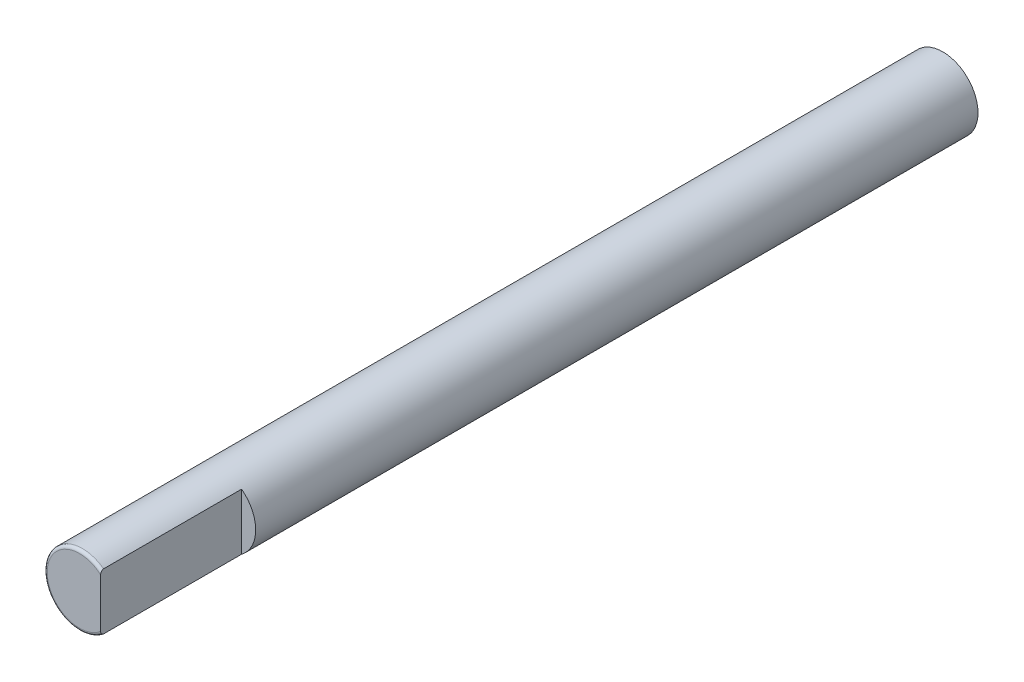
ISO-10303-21;
HEADER;
FILE_DESCRIPTION(('STEP AP214'),'2;1');
FILE_NAME('part.step','',(''),(''),'','','');
FILE_SCHEMA(('AUTOMOTIVE_DESIGN { 1 0 10303 214 1 1 1 1 }'));
ENDSEC;
DATA;
#1=APPLICATION_CONTEXT('core data for automotive mechanical design processes');
#2=APPLICATION_PROTOCOL_DEFINITION('international standard','automotive_design',2000,#1);
#3=PRODUCT_CONTEXT('',#1,'mechanical');
#4=PRODUCT('Part','Part','',(#3));
#5=PRODUCT_RELATED_PRODUCT_CATEGORY('part','',(#4));
#6=PRODUCT_DEFINITION_FORMATION('','',#4);
#7=PRODUCT_DEFINITION_CONTEXT('part definition',#1,'design');
#8=PRODUCT_DEFINITION('design','',#6,#7);
#9=PRODUCT_DEFINITION_SHAPE('','',#8);
#10=(LENGTH_UNIT() NAMED_UNIT(*) SI_UNIT(.MILLI.,.METRE.));
#11=(NAMED_UNIT(*) PLANE_ANGLE_UNIT() SI_UNIT($,.RADIAN.));
#12=(NAMED_UNIT(*) SI_UNIT($,.STERADIAN.) SOLID_ANGLE_UNIT());
#13=UNCERTAINTY_MEASURE_WITH_UNIT(LENGTH_MEASURE(1.E-05),#10,'distance_accuracy_value','');
#14=(GEOMETRIC_REPRESENTATION_CONTEXT(3) GLOBAL_UNCERTAINTY_ASSIGNED_CONTEXT((#13)) GLOBAL_UNIT_ASSIGNED_CONTEXT((#10,
#11,#12)) REPRESENTATION_CONTEXT('',''));
#15=CARTESIAN_POINT('',(0.,0.,0.));
#16=DIRECTION('',(0.,0.,1.));
#17=DIRECTION('',(1.,0.,0.));
#18=AXIS2_PLACEMENT_3D('',#15,#16,#17);
#19=CARTESIAN_POINT('',(0.,0.,73.5));
#20=DIRECTION('',(0.,0.,-1.));
#21=DIRECTION('',(-1.,0.,0.));
#22=AXIS2_PLACEMENT_3D('',#19,#20,#21);
#23=CYLINDRICAL_SURFACE('',#22,3.);
#24=CARTESIAN_POINT('',(0.,0.,73.25));
#25=DIRECTION('',(0.,0.,1.));
#26=DIRECTION('',(1.,0.,0.));
#27=AXIS2_PLACEMENT_3D('',#24,#25,#26);
#28=CIRCLE('',#27,3.);
#29=CARTESIAN_POINT('',(1.8,-2.4,73.25));
#30=VERTEX_POINT('',#29);
#31=CARTESIAN_POINT('',(1.8,2.4,73.25));
#32=VERTEX_POINT('',#31);
#33=EDGE_CURVE('E73',#30,#32,#28,.F.);
#34=ORIENTED_EDGE('',*,*,#33,.T.);
#35=DIRECTION('',(0.,0.,-1.));
#36=VECTOR('',#35,1.);
#37=CARTESIAN_POINT('',(1.8,2.4,73.5));
#38=LINE('',#37,#36);
#39=CARTESIAN_POINT('',(1.8,2.4,61.5));
#40=VERTEX_POINT('',#39);
#41=EDGE_CURVE('E50',#32,#40,#38,.T.);
#42=ORIENTED_EDGE('',*,*,#41,.T.);
#43=CARTESIAN_POINT('',(0.,0.,61.5));
#44=DIRECTION('',(0.,0.,1.));
#45=DIRECTION('',(1.,0.,0.));
#46=AXIS2_PLACEMENT_3D('',#43,#44,#45);
#47=CIRCLE('',#46,3.);
#48=CARTESIAN_POINT('',(1.8,-2.4,61.5));
#49=VERTEX_POINT('',#48);
#50=EDGE_CURVE('E11',#49,#40,#47,.T.);
#51=ORIENTED_EDGE('',*,*,#50,.F.);
#52=DIRECTION('',(0.,0.,-1.));
#53=VECTOR('',#52,1.);
#54=CARTESIAN_POINT('',(1.8,-2.4,73.5));
#55=LINE('',#54,#53);
#56=EDGE_CURVE('E85',#49,#30,#55,.F.);
#57=ORIENTED_EDGE('',*,*,#56,.T.);
#58=EDGE_LOOP('',(#34,#42,#51,#57));
#59=FACE_BOUND('',#58,.T.);
#60=CARTESIAN_POINT('',(0.,0.,0.));
#61=DIRECTION('',(0.,0.,1.));
#62=DIRECTION('',(1.,0.,0.));
#63=AXIS2_PLACEMENT_3D('',#60,#61,#62);
#64=CIRCLE('',#63,3.);
#65=CARTESIAN_POINT('',(3.,0.,0.));
#66=VERTEX_POINT('',#65);
#67=EDGE_CURVE('E81',#66,#66,#64,.T.);
#68=ORIENTED_EDGE('',*,*,#67,.T.);
#69=EDGE_LOOP('',(#68));
#70=FACE_BOUND('',#69,.T.);
#71=ADVANCED_FACE('F34',(#59,#70),#23,.T.);
#72=CARTESIAN_POINT('',(0.,0.,73.5));
#73=DIRECTION('',(0.,0.,1.));
#74=DIRECTION('',(1.,0.,0.));
#75=AXIS2_PLACEMENT_3D('',#72,#73,#74);
#76=PLANE('',#75);
#77=DIRECTION('',(0.,-1.,0.));
#78=VECTOR('',#77,1.);
#79=CARTESIAN_POINT('',(1.8,6.32053002271448,73.5));
#80=LINE('',#79,#78);
#81=CARTESIAN_POINT('',(1.8,2.07906228862918,73.5));
#82=VERTEX_POINT('',#81);
#83=CARTESIAN_POINT('',(1.8,-2.07906228862918,73.5));
#84=VERTEX_POINT('',#83);
#85=EDGE_CURVE('E68',#82,#84,#80,.T.);
#86=ORIENTED_EDGE('',*,*,#85,.F.);
#87=CARTESIAN_POINT('',(0.,0.,73.5));
#88=DIRECTION('',(0.,0.,1.));
#89=DIRECTION('',(1.,0.,0.));
#90=AXIS2_PLACEMENT_3D('',#87,#88,#89);
#91=CIRCLE('',#90,2.75);
#92=EDGE_CURVE('E78',#82,#84,#91,.T.);
#93=ORIENTED_EDGE('',*,*,#92,.T.);
#94=EDGE_LOOP('',(#86,#93));
#95=FACE_BOUND('',#94,.T.);
#96=ADVANCED_FACE('F77',(#95),#76,.T.);
#97=CARTESIAN_POINT('',(0.,0.,0.));
#98=DIRECTION('',(0.,0.,1.));
#99=DIRECTION('',(1.,0.,0.));
#100=AXIS2_PLACEMENT_3D('',#97,#98,#99);
#101=PLANE('',#100);
#102=ORIENTED_EDGE('',*,*,#67,.F.);
#103=EDGE_LOOP('',(#102));
#104=FACE_BOUND('',#103,.T.);
#105=ADVANCED_FACE('F101',(#104),#101,.F.);
#106=CARTESIAN_POINT('',(0.,0.,73.25));
#107=DIRECTION('',(0.,0.,1.));
#108=DIRECTION('',(1.,0.,0.));
#109=AXIS2_PLACEMENT_3D('',#106,#107,#108);
#110=TOROIDAL_SURFACE('',#109,2.75,0.25);
#111=CARTESIAN_POINT('',(1.8,-2.39706109796547,73.284201990612));
#112=CARTESIAN_POINT('',(1.8,-2.39902661439154,73.2728163101675));
#113=CARTESIAN_POINT('',(1.8,-2.40001754040991,73.2612470336484));
#114=CARTESIAN_POINT('',(1.8,-2.39998192866446,73.2381003486589));
#115=CARTESIAN_POINT('',(1.8,-2.39895220771537,73.226522956125));
#116=CARTESIAN_POINT('',(1.8,-2.39493773183844,73.2037414985433));
#117=CARTESIAN_POINT('',(1.8,-2.39195749067822,73.1925366341693));
#118=CARTESIAN_POINT('',(1.8,-2.38421130271066,73.1707700897566));
#119=CARTESIAN_POINT('',(1.8,-2.37944548070846,73.1602083648249));
#120=CARTESIAN_POINT('',(1.8,-2.36819433502219,73.139647326478));
#121=CARTESIAN_POINT('',(1.8,-2.36166284627394,73.1296734564962));
#122=CARTESIAN_POINT('',(1.8,-2.34722357074628,73.1107839279419));
#123=CARTESIAN_POINT('',(1.8,-2.33931533877296,73.1018686132451));
#124=CARTESIAN_POINT('',(1.8,-2.32112174531674,73.0839271199738));
#125=CARTESIAN_POINT('',(1.8,-2.31065776051762,73.0750825672486));
#126=CARTESIAN_POINT('',(1.8,-2.28861116220731,73.0589218266716));
#127=CARTESIAN_POINT('',(1.8,-2.27702755336311,73.0516070173604));
#128=CARTESIAN_POINT('',(1.8,-2.24728393546609,73.0353427904574));
#129=CARTESIAN_POINT('',(1.8,-2.22863142230522,73.0272885186802));
#130=CARTESIAN_POINT('',(1.8,-2.19026651263108,73.0143261100931));
#131=CARTESIAN_POINT('',(1.8,-2.17055264569698,73.0094224664698));
#132=CARTESIAN_POINT('',(1.8,-2.1303696437816,73.0025444741948));
#133=CARTESIAN_POINT('',(1.8,-2.10989408290637,73.0006082828381));
#134=CARTESIAN_POINT('',(1.8,-2.06887654196433,72.9996359309138));
#135=CARTESIAN_POINT('',(1.8,-2.04833454167265,73.0006007570954));
#136=CARTESIAN_POINT('',(1.8,-2.00387635220084,73.0057729640167));
#137=CARTESIAN_POINT('',(1.8,-1.98002325874309,73.0105362413968));
#138=CARTESIAN_POINT('',(1.8,-1.93343279752272,73.0239846273354));
#139=CARTESIAN_POINT('',(1.8,-1.91069503886862,73.0326683508489));
#140=CARTESIAN_POINT('',(1.8,-1.87327911742088,73.051121454968));
#141=CARTESIAN_POINT('',(1.8,-1.85811880679183,73.0599164209668));
#142=CARTESIAN_POINT('',(1.8,-1.82932924044325,73.0797350563911));
#143=CARTESIAN_POINT('',(1.8,-1.81569732947618,73.0907547645068));
#144=CARTESIAN_POINT('',(1.8,-1.79392414062347,73.1119368907138));
#145=CARTESIAN_POINT('',(1.8,-1.78527672483479,73.1215775479683));
#146=CARTESIAN_POINT('',(1.8,-1.76960981208313,73.14210775156));
#147=CARTESIAN_POINT('',(1.8,-1.76258810672575,73.1529955732953));
#148=CARTESIAN_POINT('',(1.8,-1.75175411259749,73.1737692062774));
#149=CARTESIAN_POINT('',(1.8,-1.74758882741731,73.1834698494339));
#150=CARTESIAN_POINT('',(1.8,-1.74092963080889,73.2034312307229));
#151=CARTESIAN_POINT('',(1.8,-1.73843443855203,73.2136915330948));
#152=CARTESIAN_POINT('',(1.8,-1.73530613051802,73.2345453936616));
#153=CARTESIAN_POINT('',(1.8,-1.73468161234084,73.2451402650946));
#154=CARTESIAN_POINT('',(1.8,-1.73537618950258,73.2662656928518));
#155=CARTESIAN_POINT('',(1.8,-1.73669533295005,73.2767962475776));
#156=CARTESIAN_POINT('',(1.8,-1.74100169421987,73.2967270796783));
#157=CARTESIAN_POINT('',(1.8,-1.74386508896738,73.3061547653927));
#158=CARTESIAN_POINT('',(1.8,-1.75097915632728,73.3244667890985));
#159=CARTESIAN_POINT('',(1.8,-1.755230408844,73.3333508981152));
#160=CARTESIAN_POINT('',(1.8,-1.76682710326082,73.3538604689863));
#161=CARTESIAN_POINT('',(1.8,-1.77473066463679,73.3651704221748));
#162=CARTESIAN_POINT('',(1.8,-1.79225754473849,73.3863689759598));
#163=CARTESIAN_POINT('',(1.8,-1.80188451703579,73.3962544747964));
#164=CARTESIAN_POINT('',(1.8,-1.82628807884876,73.4180672524556));
#165=CARTESIAN_POINT('',(1.8,-1.84163579926768,73.4293541403315));
#166=CARTESIAN_POINT('',(1.8,-1.87391876339058,73.4493451012443));
#167=CARTESIAN_POINT('',(1.8,-1.89085635585223,73.4580452712598));
#168=CARTESIAN_POINT('',(1.8,-1.93052581595086,73.475010682494));
#169=CARTESIAN_POINT('',(1.8,-1.95358281895593,73.4825172863874));
#170=CARTESIAN_POINT('',(1.8,-2.00061409373267,73.4936564028915));
#171=CARTESIAN_POINT('',(1.8,-2.0245890501721,73.4972859630639));
#172=CARTESIAN_POINT('',(1.8,-2.07297778509116,73.5006267768205));
#173=CARTESIAN_POINT('',(1.8,-2.09739343281061,73.5003114319531));
#174=CARTESIAN_POINT('',(1.8,-2.14580767896284,73.4954980521769));
#175=CARTESIAN_POINT('',(1.8,-2.16980675319382,73.4910051597119));
#176=CARTESIAN_POINT('',(1.8,-2.21088288292009,73.4791816894187));
#177=CARTESIAN_POINT('',(1.8,-2.2282332134692,73.4727970657899));
#178=CARTESIAN_POINT('',(1.8,-2.26168676506145,73.4573232843079));
#179=CARTESIAN_POINT('',(1.8,-2.27779166165457,73.448237842685));
#180=CARTESIAN_POINT('',(1.8,-2.30505694059715,73.4293857917399));
#181=CARTESIAN_POINT('',(1.8,-2.31656210868377,73.4201186065707));
#182=CARTESIAN_POINT('',(1.8,-2.33791959583899,73.3998265069834));
#183=CARTESIAN_POINT('',(1.8,-2.34777289162888,73.3888026388347));
#184=CARTESIAN_POINT('',(1.8,-2.36395791868741,73.36699057436));
#185=CARTESIAN_POINT('',(1.8,-2.37059894993887,73.3564319556196));
#186=CARTESIAN_POINT('',(1.8,-2.38202134346626,73.3343675049721));
#187=CARTESIAN_POINT('',(1.8,-2.38680765941267,73.3228642970401));
#188=CARTESIAN_POINT('',(1.8,-2.39192018117289,73.306647684426));
#189=CARTESIAN_POINT('',(1.8,-2.39315926685606,73.3022090508285));
#190=CARTESIAN_POINT('',(1.8,-2.39533770371464,73.2932573643359));
#191=CARTESIAN_POINT('',(1.8,-2.39627695860572,73.2887442880234));
#192=CARTESIAN_POINT('',(1.8,-2.39706109796547,73.284201990612));
#193=B_SPLINE_CURVE_WITH_KNOTS('',3,(#111,#112,#113,#114,#115,#116,#117,#118,#119,#120,#121,
#122,#123,#124,#125,#126,#127,#128,#129,#130,#131,#132,#133,#134,#135,#136,#137,#138,#139,#140,
#141,#142,#143,#144,#145,#146,#147,#148,#149,#150,#151,#152,#153,#154,#155,#156,#157,#158,#159,
#160,#161,#162,#163,#164,#165,#166,#167,#168,#169,#170,#171,#172,#173,#174,#175,#176,#177,#178,
#179,#180,#181,#182,#183,#184,#185,#186,#187,#188,#189,#190,#191,#192),.UNSPECIFIED.,.T.,.F.,(4,
2,2,2,2,2,2,2,2,2,2,2,2,2,2,2,2,2,2,2,2,2,2,2,2,2,2,2,2,2,2,2,2,2,2,2,2,2,2,2,4),(0.,
0.034644042643479,0.0693427048916943,0.103961352315656,0.138577580482541,0.17420506239669,
0.209844086550378,0.250796343422248,0.291785347220273,0.352406603927271,0.413114123287584,
0.474595894781904,0.53609858098988,0.608746070916714,0.681367915445793,0.73378260837926,
0.786104783582707,0.824826157367107,0.863494618615541,0.895036257283324,0.926553678217301,
0.958215732344205,0.989878570167871,1.01931485931357,1.04876346393393,1.08992777434589,
1.13118040800182,1.18802429013944,1.2449535120419,1.31733068500314,1.38976293527191,
1.46268382043059,1.53551506069714,1.59077766682344,1.64596458276834,1.69011701950463,
1.7342432569414,1.77151250070657,1.80868150622349,1.82249825427956,1.83631943483924),.UNSPECIFIED.);
#194=EDGE_CURVE('E43',#84,#30,#193,.T.);
#195=ORIENTED_EDGE('',*,*,#194,.F.);
#196=ORIENTED_EDGE('',*,*,#92,.F.);
#197=CARTESIAN_POINT('',(1.8,1.73682238862248,73.2755599898853));
#198=CARTESIAN_POINT('',(1.8,1.73528432673162,73.2651559803733));
#199=CARTESIAN_POINT('',(1.8,1.73467801784105,73.2546012865118));
#200=CARTESIAN_POINT('',(1.8,1.73539480869917,73.233544543839));
#201=CARTESIAN_POINT('',(1.8,1.73672147703429,73.2230426284071));
#202=CARTESIAN_POINT('',(1.8,1.74118026428858,73.2024869633641));
#203=CARTESIAN_POINT('',(1.8,1.74430385716297,73.1924313372236));
#204=CARTESIAN_POINT('',(1.8,1.75211626511289,73.1729563811341));
#205=CARTESIAN_POINT('',(1.8,1.75680562596909,73.1635372744356));
#206=CARTESIAN_POINT('',(1.8,1.76925133967165,73.1424737490028));
#207=CARTESIAN_POINT('',(1.8,1.77750907978469,73.1311263556367));
#208=CARTESIAN_POINT('',(1.8,1.79574081702543,73.1099079534148));
#209=CARTESIAN_POINT('',(1.8,1.80571819133543,73.100039922559));
#210=CARTESIAN_POINT('',(1.8,1.83096227202058,73.0783049298824));
#211=CARTESIAN_POINT('',(1.8,1.84679897254203,73.0671014435793));
#212=CARTESIAN_POINT('',(1.8,1.88004175885871,73.0473550921328));
#213=CARTESIAN_POINT('',(1.8,1.89745016996245,73.0388162552798));
#214=CARTESIAN_POINT('',(1.8,1.93790635190941,73.0224105717401));
#215=CARTESIAN_POINT('',(1.8,1.96125361200616,73.0152804357781));
#216=CARTESIAN_POINT('',(1.8,2.00880278854856,73.0049447732444));
#217=CARTESIAN_POINT('',(1.8,2.03300532515349,73.0017421571804));
#218=CARTESIAN_POINT('',(1.8,2.08175135262325,72.9993291480165));
#219=CARTESIAN_POINT('',(1.8,2.10629599636883,73.0001413594121));
#220=CARTESIAN_POINT('',(1.8,2.1548671588537,73.0060287291737));
#221=CARTESIAN_POINT('',(1.8,2.17889434985612,73.0110979652892));
#222=CARTESIAN_POINT('',(1.8,2.21945086926578,73.0238770997754));
#223=CARTESIAN_POINT('',(1.8,2.23630580312407,73.0305581674241));
#224=CARTESIAN_POINT('',(1.8,2.26873026037521,73.046538755883));
#225=CARTESIAN_POINT('',(1.8,2.28430144330536,73.0558348253395));
#226=CARTESIAN_POINT('',(1.8,2.31063691543318,73.0750125323921));
#227=CARTESIAN_POINT('',(1.8,2.32174489023072,73.0844213598864));
#228=CARTESIAN_POINT('',(1.8,2.34228111494452,73.1049277479546));
#229=CARTESIAN_POINT('',(1.8,2.35171111157143,73.1160235298887));
#230=CARTESIAN_POINT('',(1.8,2.36714311706929,73.1379421127913));
#231=CARTESIAN_POINT('',(1.8,2.37344813134707,73.1485510272967));
#232=CARTESIAN_POINT('',(1.8,2.38420517842712,73.1706749765665));
#233=CARTESIAN_POINT('',(1.8,2.38865801369491,73.1821896163444));
#234=CARTESIAN_POINT('',(1.8,2.39547210509684,73.205884774615));
#235=CARTESIAN_POINT('',(1.8,2.39782378108808,73.2180680769117));
#236=CARTESIAN_POINT('',(1.8,2.40024520317826,73.2426596071572));
#237=CARTESIAN_POINT('',(1.8,2.40031560083556,73.2550677698703));
#238=CARTESIAN_POINT('',(1.8,2.398259562236,73.2786881603427));
#239=CARTESIAN_POINT('',(1.8,2.39630947252789,73.2899162684148));
#240=CARTESIAN_POINT('',(1.8,2.39058982946711,73.311895649091));
#241=CARTESIAN_POINT('',(1.8,2.38682022911547,73.3226469093699));
#242=CARTESIAN_POINT('',(1.8,2.3775492738555,73.3436536378739));
#243=CARTESIAN_POINT('',(1.8,2.37201150827431,73.3538929104725));
#244=CARTESIAN_POINT('',(1.8,2.35947975122561,73.3734320601189));
#245=CARTESIAN_POINT('',(1.8,2.35248533011889,73.3827316588063));
#246=CARTESIAN_POINT('',(1.8,2.33633690821079,73.4013875541465));
#247=CARTESIAN_POINT('',(1.8,2.32702197231845,73.4106040895098));
#248=CARTESIAN_POINT('',(1.8,2.30719945177581,73.4276471359907));
#249=CARTESIAN_POINT('',(1.8,2.29669088349452,73.4354724868603));
#250=CARTESIAN_POINT('',(1.8,2.26966205562044,73.4530448875169));
#251=CARTESIAN_POINT('',(1.8,2.25261933246809,73.461992412136));
#252=CARTESIAN_POINT('',(1.8,2.21730651746866,73.4769921708888));
#253=CARTESIAN_POINT('',(1.8,2.19903463217675,73.4830400649614));
#254=CARTESIAN_POINT('',(1.8,2.16155697209894,73.4924510764184));
#255=CARTESIAN_POINT('',(1.8,2.14234187703435,73.4957765690719));
#256=CARTESIAN_POINT('',(1.8,2.10364670336728,73.4997513036945));
#257=CARTESIAN_POINT('',(1.8,2.08416660936323,73.5004003894401));
#258=CARTESIAN_POINT('',(1.8,2.04125946481308,73.4989994363156));
#259=CARTESIAN_POINT('',(1.8,2.01785025658026,73.4963627508437));
#260=CARTESIAN_POINT('',(1.8,1.97172240785038,73.4874235776927));
#261=CARTESIAN_POINT('',(1.8,1.94900413460504,73.4811191751509));
#262=CARTESIAN_POINT('',(1.8,1.90853149332682,73.4661158709573));
#263=CARTESIAN_POINT('',(1.8,1.89057079634076,73.4579732869413));
#264=CARTESIAN_POINT('',(1.8,1.85615443284343,73.4389608788135));
#265=CARTESIAN_POINT('',(1.8,1.83969615378642,73.4280959168168));
#266=CARTESIAN_POINT('',(1.8,1.81348557522401,73.407038837141));
#267=CARTESIAN_POINT('',(1.8,1.8031664647459,73.3975529057793));
#268=CARTESIAN_POINT('',(1.8,1.78411240434631,73.3770882688659));
#269=CARTESIAN_POINT('',(1.8,1.77537595493775,73.3661109937263));
#270=CARTESIAN_POINT('',(1.8,1.76162939667625,73.3451615981862));
#271=CARTESIAN_POINT('',(1.8,1.7562223113548,73.3354508919323));
#272=CARTESIAN_POINT('',(1.8,1.74708603647476,73.3152861911322));
#273=CARTESIAN_POINT('',(1.8,1.74335146597055,73.3048347074293));
#274=CARTESIAN_POINT('',(1.8,1.73900923634442,73.2880187870397));
#275=CARTESIAN_POINT('',(1.8,1.73774733089802,73.2818166355313));
#276=CARTESIAN_POINT('',(1.8,1.73682238862248,73.2755599898853));
#277=B_SPLINE_CURVE_WITH_KNOTS('',3,(#197,#198,#199,#200,#201,#202,#203,#204,#205,#206,#207,
#208,#209,#210,#211,#212,#213,#214,#215,#216,#217,#218,#219,#220,#221,#222,#223,#224,#225,#226,
#227,#228,#229,#230,#231,#232,#233,#234,#235,#236,#237,#238,#239,#240,#241,#242,#243,#244,#245,
#246,#247,#248,#249,#250,#251,#252,#253,#254,#255,#256,#257,#258,#259,#260,#261,#262,#263,#264,
#265,#266,#267,#268,#269,#270,#271,#272,#273,#274,#275,#276),.UNSPECIFIED.,.T.,.F.,(4,2,2,2,2,2,
2,2,2,2,2,2,2,2,2,2,2,2,2,2,2,2,2,2,2,2,2,2,2,2,2,2,2,2,2,2,2,2,2,4),(0.,0.0315279975896928,
0.0631142747289682,0.0945519031409859,0.126000501245541,0.167871410083182,0.209825506034158,
0.267707853971195,0.3256772864733,0.398545179453304,0.471467038971409,0.544799933106226,
0.618030977304901,0.672227804677285,0.726353434465774,0.769858661352501,0.813318332610011,
0.850185850804983,0.887037379289792,0.924056085693892,0.96106421905234,0.995093915433364,
1.02912449086749,1.06390670734148,1.09869919736455,1.13786434084943,1.17706199637954,
1.23449445380937,1.29201260773557,1.35031287026432,1.40861653576623,1.47899132177691,
1.54940288247374,1.60836090605076,1.6672143730538,1.70913088038947,1.75100746396066,
1.78422606283282,1.81733700665792,1.83629695749408),.UNSPECIFIED.);
#278=EDGE_CURVE('E65',#32,#82,#277,.T.);
#279=ORIENTED_EDGE('',*,*,#278,.F.);
#280=ORIENTED_EDGE('',*,*,#33,.F.);
#281=EDGE_LOOP('',(#195,#196,#279,#280));
#282=FACE_BOUND('',#281,.T.);
#283=ADVANCED_FACE('F36',(#282),#110,.T.);
#284=CARTESIAN_POINT('',(0.,0.,61.5));
#285=DIRECTION('',(0.,0.,1.));
#286=DIRECTION('',(1.,0.,0.));
#287=AXIS2_PLACEMENT_3D('',#284,#285,#286);
#288=PLANE('',#287);
#289=ORIENTED_EDGE('',*,*,#50,.T.);
#290=DIRECTION('',(0.,-1.,0.));
#291=VECTOR('',#290,1.);
#292=CARTESIAN_POINT('',(1.8,6.32053002271448,61.5));
#293=LINE('',#292,#291);
#294=EDGE_CURVE('E79',#40,#49,#293,.T.);
#295=ORIENTED_EDGE('',*,*,#294,.T.);
#296=EDGE_LOOP('',(#289,#295));
#297=FACE_BOUND('',#296,.T.);
#298=ADVANCED_FACE('F97',(#297),#288,.T.);
#299=CARTESIAN_POINT('',(1.8,6.32053002271448,61.5));
#300=DIRECTION('',(-1.,0.,0.));
#301=DIRECTION('',(0.,-1.,0.));
#302=AXIS2_PLACEMENT_3D('',#299,#300,#301);
#303=PLANE('',#302);
#304=ORIENTED_EDGE('',*,*,#294,.F.);
#305=ORIENTED_EDGE('',*,*,#41,.F.);
#306=ORIENTED_EDGE('',*,*,#278,.T.);
#307=ORIENTED_EDGE('',*,*,#85,.T.);
#308=ORIENTED_EDGE('',*,*,#194,.T.);
#309=ORIENTED_EDGE('',*,*,#56,.F.);
#310=EDGE_LOOP('',(#304,#305,#306,#307,#308,#309));
#311=FACE_BOUND('',#310,.T.);
#312=ADVANCED_FACE('F67',(#311),#303,.F.);
#313=CLOSED_SHELL('',(#71,#96,#105,#283,#298,#312));
#314=MANIFOLD_SOLID_BREP('B2',#313);
#315=ADVANCED_BREP_SHAPE_REPRESENTATION('',(#18,#314),#14);
#316=SHAPE_DEFINITION_REPRESENTATION(#9,#315);
ENDSEC;
END-ISO-10303-21;
